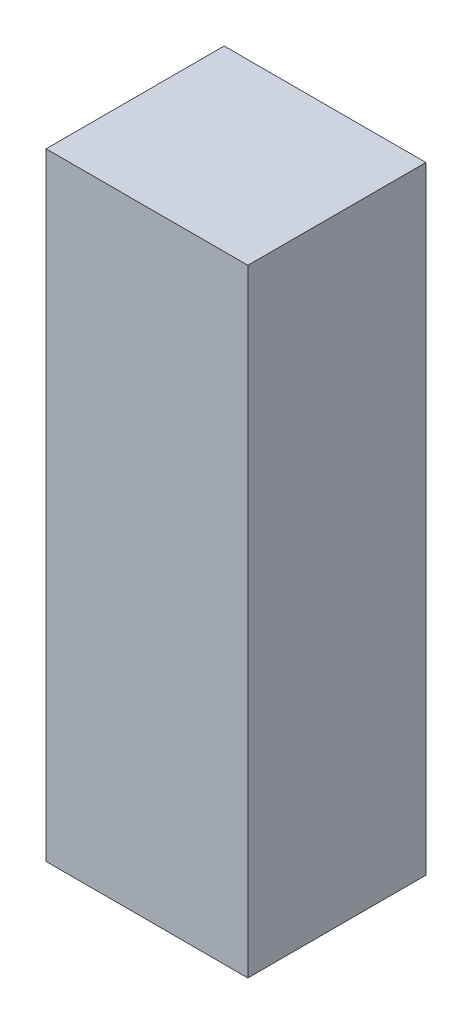
ISO-10303-21;
HEADER;
FILE_DESCRIPTION(('STEP AP214'),'2;1');
FILE_NAME('part.step','',(''),(''),'','','');
FILE_SCHEMA(('AUTOMOTIVE_DESIGN { 1 0 10303 214 1 1 1 1 }'));
ENDSEC;
DATA;
#1=APPLICATION_CONTEXT('core data for automotive mechanical design processes');
#2=APPLICATION_PROTOCOL_DEFINITION('international standard','automotive_design',2000,#1);
#3=PRODUCT_CONTEXT('',#1,'mechanical');
#4=PRODUCT('Part','Part','',(#3));
#5=PRODUCT_RELATED_PRODUCT_CATEGORY('part','',(#4));
#6=PRODUCT_DEFINITION_FORMATION('','',#4);
#7=PRODUCT_DEFINITION_CONTEXT('part definition',#1,'design');
#8=PRODUCT_DEFINITION('design','',#6,#7);
#9=PRODUCT_DEFINITION_SHAPE('','',#8);
#10=(LENGTH_UNIT() NAMED_UNIT(*) SI_UNIT(.MILLI.,.METRE.));
#11=(NAMED_UNIT(*) PLANE_ANGLE_UNIT() SI_UNIT($,.RADIAN.));
#12=(NAMED_UNIT(*) SI_UNIT($,.STERADIAN.) SOLID_ANGLE_UNIT());
#13=UNCERTAINTY_MEASURE_WITH_UNIT(LENGTH_MEASURE(1.E-05),#10,'distance_accuracy_value','');
#14=(GEOMETRIC_REPRESENTATION_CONTEXT(3) GLOBAL_UNCERTAINTY_ASSIGNED_CONTEXT((#13)) GLOBAL_UNIT_ASSIGNED_CONTEXT((#10,
#11,#12)) REPRESENTATION_CONTEXT('',''));
#15=CARTESIAN_POINT('',(0.,0.,0.));
#16=DIRECTION('',(0.,0.,1.));
#17=DIRECTION('',(1.,0.,0.));
#18=AXIS2_PLACEMENT_3D('',#15,#16,#17);
#19=CARTESIAN_POINT('',(-17.,104.,15.));
#20=DIRECTION('',(1.,0.,0.));
#21=DIRECTION('',(0.,0.,-1.));
#22=AXIS2_PLACEMENT_3D('',#19,#20,#21);
#23=PLANE('',#22);
#24=DIRECTION('',(0.,0.,1.));
#25=VECTOR('',#24,1.);
#26=CARTESIAN_POINT('',(-17.,0.,15.));
#27=LINE('',#26,#25);
#28=CARTESIAN_POINT('',(-17.,0.,-15.));
#29=VERTEX_POINT('',#28);
#30=CARTESIAN_POINT('',(-17.,0.,15.));
#31=VERTEX_POINT('',#30);
#32=EDGE_CURVE('E113',#29,#31,#27,.T.);
#33=ORIENTED_EDGE('',*,*,#32,.T.);
#34=DIRECTION('',(0.,-1.,0.));
#35=VECTOR('',#34,1.);
#36=CARTESIAN_POINT('',(-17.,104.,15.));
#37=LINE('',#36,#35);
#38=CARTESIAN_POINT('',(-17.,104.,15.));
#39=VERTEX_POINT('',#38);
#40=EDGE_CURVE('E11',#39,#31,#37,.T.);
#41=ORIENTED_EDGE('',*,*,#40,.F.);
#42=DIRECTION('',(0.,0.,1.));
#43=VECTOR('',#42,1.);
#44=CARTESIAN_POINT('',(-17.,104.,15.));
#45=LINE('',#44,#43);
#46=CARTESIAN_POINT('',(-17.,104.,-15.));
#47=VERTEX_POINT('',#46);
#48=EDGE_CURVE('E97',#47,#39,#45,.T.);
#49=ORIENTED_EDGE('',*,*,#48,.F.);
#50=DIRECTION('',(0.,-1.,0.));
#51=VECTOR('',#50,1.);
#52=CARTESIAN_POINT('',(-17.,104.,-15.));
#53=LINE('',#52,#51);
#54=EDGE_CURVE('E109',#47,#29,#53,.T.);
#55=ORIENTED_EDGE('',*,*,#54,.T.);
#56=EDGE_LOOP('',(#33,#41,#49,#55));
#57=FACE_BOUND('',#56,.T.);
#58=ADVANCED_FACE('F45',(#57),#23,.F.);
#59=CARTESIAN_POINT('',(17.,104.,15.));
#60=DIRECTION('',(0.,0.,-1.));
#61=DIRECTION('',(-1.,0.,0.));
#62=AXIS2_PLACEMENT_3D('',#59,#60,#61);
#63=PLANE('',#62);
#64=DIRECTION('',(1.,0.,0.));
#65=VECTOR('',#64,1.);
#66=CARTESIAN_POINT('',(17.,0.,15.));
#67=LINE('',#66,#65);
#68=CARTESIAN_POINT('',(17.,0.,15.));
#69=VERTEX_POINT('',#68);
#70=EDGE_CURVE('E102',#31,#69,#67,.T.);
#71=ORIENTED_EDGE('',*,*,#70,.T.);
#72=DIRECTION('',(0.,-1.,0.));
#73=VECTOR('',#72,1.);
#74=CARTESIAN_POINT('',(17.,104.,15.));
#75=LINE('',#74,#73);
#76=CARTESIAN_POINT('',(17.,104.,15.));
#77=VERTEX_POINT('',#76);
#78=EDGE_CURVE('E54',#77,#69,#75,.T.);
#79=ORIENTED_EDGE('',*,*,#78,.F.);
#80=DIRECTION('',(1.,0.,0.));
#81=VECTOR('',#80,1.);
#82=CARTESIAN_POINT('',(17.,104.,15.));
#83=LINE('',#82,#81);
#84=EDGE_CURVE('E92',#39,#77,#83,.T.);
#85=ORIENTED_EDGE('',*,*,#84,.F.);
#86=ORIENTED_EDGE('',*,*,#40,.T.);
#87=EDGE_LOOP('',(#71,#79,#85,#86));
#88=FACE_BOUND('',#87,.T.);
#89=ADVANCED_FACE('F101',(#88),#63,.F.);
#90=CARTESIAN_POINT('',(17.,104.,15.));
#91=DIRECTION('',(-1.,0.,0.));
#92=DIRECTION('',(0.,0.,1.));
#93=AXIS2_PLACEMENT_3D('',#90,#91,#92);
#94=PLANE('',#93);
#95=DIRECTION('',(0.,0.,-1.));
#96=VECTOR('',#95,1.);
#97=CARTESIAN_POINT('',(17.,0.,15.));
#98=LINE('',#97,#96);
#99=CARTESIAN_POINT('',(17.,0.,-15.));
#100=VERTEX_POINT('',#99);
#101=EDGE_CURVE('E79',#69,#100,#98,.T.);
#102=ORIENTED_EDGE('',*,*,#101,.T.);
#103=DIRECTION('',(0.,-1.,0.));
#104=VECTOR('',#103,1.);
#105=CARTESIAN_POINT('',(17.,104.,-15.));
#106=LINE('',#105,#104);
#107=CARTESIAN_POINT('',(17.,104.,-15.));
#108=VERTEX_POINT('',#107);
#109=EDGE_CURVE('E104',#108,#100,#106,.T.);
#110=ORIENTED_EDGE('',*,*,#109,.F.);
#111=DIRECTION('',(0.,0.,-1.));
#112=VECTOR('',#111,1.);
#113=CARTESIAN_POINT('',(17.,104.,15.));
#114=LINE('',#113,#112);
#115=EDGE_CURVE('E95',#77,#108,#114,.T.);
#116=ORIENTED_EDGE('',*,*,#115,.F.);
#117=ORIENTED_EDGE('',*,*,#78,.T.);
#118=EDGE_LOOP('',(#102,#110,#116,#117));
#119=FACE_BOUND('',#118,.T.);
#120=ADVANCED_FACE('F105',(#119),#94,.F.);
#121=CARTESIAN_POINT('',(17.,104.,-15.));
#122=DIRECTION('',(0.,0.,1.));
#123=DIRECTION('',(1.,0.,0.));
#124=AXIS2_PLACEMENT_3D('',#121,#122,#123);
#125=PLANE('',#124);
#126=DIRECTION('',(-1.,0.,0.));
#127=VECTOR('',#126,1.);
#128=CARTESIAN_POINT('',(17.,0.,-15.));
#129=LINE('',#128,#127);
#130=EDGE_CURVE('E85',#100,#29,#129,.T.);
#131=ORIENTED_EDGE('',*,*,#130,.T.);
#132=ORIENTED_EDGE('',*,*,#54,.F.);
#133=DIRECTION('',(-1.,0.,0.));
#134=VECTOR('',#133,1.);
#135=CARTESIAN_POINT('',(17.,104.,-15.));
#136=LINE('',#135,#134);
#137=EDGE_CURVE('E62',#108,#47,#136,.T.);
#138=ORIENTED_EDGE('',*,*,#137,.F.);
#139=ORIENTED_EDGE('',*,*,#109,.T.);
#140=EDGE_LOOP('',(#131,#132,#138,#139));
#141=FACE_BOUND('',#140,.T.);
#142=ADVANCED_FACE('F126',(#141),#125,.F.);
#143=CARTESIAN_POINT('',(0.,104.,0.));
#144=DIRECTION('',(0.,1.,0.));
#145=DIRECTION('',(0.,0.,1.));
#146=AXIS2_PLACEMENT_3D('',#143,#144,#145);
#147=PLANE('',#146);
#148=ORIENTED_EDGE('',*,*,#48,.T.);
#149=ORIENTED_EDGE('',*,*,#84,.T.);
#150=ORIENTED_EDGE('',*,*,#115,.T.);
#151=ORIENTED_EDGE('',*,*,#137,.T.);
#152=EDGE_LOOP('',(#148,#149,#150,#151));
#153=FACE_BOUND('',#152,.T.);
#154=ADVANCED_FACE('F93',(#153),#147,.T.);
#155=CARTESIAN_POINT('',(0.,0.,0.));
#156=DIRECTION('',(0.,1.,0.));
#157=DIRECTION('',(0.,0.,1.));
#158=AXIS2_PLACEMENT_3D('',#155,#156,#157);
#159=PLANE('',#158);
#160=ORIENTED_EDGE('',*,*,#32,.F.);
#161=ORIENTED_EDGE('',*,*,#130,.F.);
#162=ORIENTED_EDGE('',*,*,#101,.F.);
#163=ORIENTED_EDGE('',*,*,#70,.F.);
#164=EDGE_LOOP('',(#160,#161,#162,#163));
#165=FACE_BOUND('',#164,.T.);
#166=ADVANCED_FACE('F129',(#165),#159,.F.);
#167=CLOSED_SHELL('',(#58,#89,#120,#142,#154,#166));
#168=MANIFOLD_SOLID_BREP('B2',#167);
#169=ADVANCED_BREP_SHAPE_REPRESENTATION('',(#18,#168),#14);
#170=SHAPE_DEFINITION_REPRESENTATION(#9,#169);
ENDSEC;
END-ISO-10303-21;
